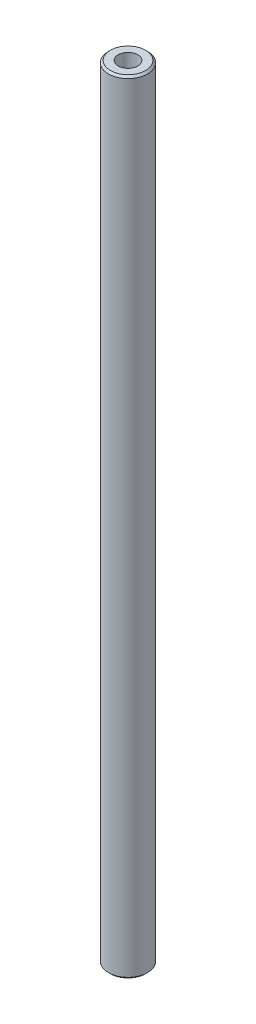
ISO-10303-21;
HEADER;
FILE_DESCRIPTION(('STEP AP214'),'2;1');
FILE_NAME('part.step','',(''),(''),'','','');
FILE_SCHEMA(('AUTOMOTIVE_DESIGN { 1 0 10303 214 1 1 1 1 }'));
ENDSEC;
DATA;
#1=APPLICATION_CONTEXT('core data for automotive mechanical design processes');
#2=APPLICATION_PROTOCOL_DEFINITION('international standard','automotive_design',2000,#1);
#3=PRODUCT_CONTEXT('',#1,'mechanical');
#4=PRODUCT('Part','Part','',(#3));
#5=PRODUCT_RELATED_PRODUCT_CATEGORY('part','',(#4));
#6=PRODUCT_DEFINITION_FORMATION('','',#4);
#7=PRODUCT_DEFINITION_CONTEXT('part definition',#1,'design');
#8=PRODUCT_DEFINITION('design','',#6,#7);
#9=PRODUCT_DEFINITION_SHAPE('','',#8);
#10=(LENGTH_UNIT() NAMED_UNIT(*) SI_UNIT(.MILLI.,.METRE.));
#11=(NAMED_UNIT(*) PLANE_ANGLE_UNIT() SI_UNIT($,.RADIAN.));
#12=(NAMED_UNIT(*) SI_UNIT($,.STERADIAN.) SOLID_ANGLE_UNIT());
#13=UNCERTAINTY_MEASURE_WITH_UNIT(LENGTH_MEASURE(1.E-05),#10,'distance_accuracy_value','');
#14=(GEOMETRIC_REPRESENTATION_CONTEXT(3) GLOBAL_UNCERTAINTY_ASSIGNED_CONTEXT((#13)) GLOBAL_UNIT_ASSIGNED_CONTEXT((#10,
#11,#12)) REPRESENTATION_CONTEXT('',''));
#15=CARTESIAN_POINT('',(0.,0.,0.));
#16=DIRECTION('',(0.,0.,1.));
#17=DIRECTION('',(1.,0.,0.));
#18=AXIS2_PLACEMENT_3D('',#15,#16,#17);
#19=CARTESIAN_POINT('',(0.,200.,0.));
#20=DIRECTION('',(0.,-1.,0.));
#21=DIRECTION('',(0.,0.,-1.));
#22=AXIS2_PLACEMENT_3D('',#19,#20,#21);
#23=CYLINDRICAL_SURFACE('',#22,5.);
#24=CARTESIAN_POINT('',(0.,199.5,0.));
#25=DIRECTION('',(0.,1.,0.));
#26=DIRECTION('',(0.,0.,1.));
#27=AXIS2_PLACEMENT_3D('',#24,#25,#26);
#28=CIRCLE('',#27,5.);
#29=CARTESIAN_POINT('',(0.,199.5,5.));
#30=VERTEX_POINT('',#29);
#31=EDGE_CURVE('E36',#30,#30,#28,.F.);
#32=ORIENTED_EDGE('',*,*,#31,.T.);
#33=EDGE_LOOP('',(#32));
#34=FACE_BOUND('',#33,.T.);
#35=CARTESIAN_POINT('',(0.,0.499999999999973,0.));
#36=DIRECTION('',(0.,1.,0.));
#37=DIRECTION('',(0.,0.,1.));
#38=AXIS2_PLACEMENT_3D('',#35,#36,#37);
#39=CIRCLE('',#38,5.);
#40=CARTESIAN_POINT('',(0.,0.499999999999973,5.));
#41=VERTEX_POINT('',#40);
#42=EDGE_CURVE('E40',#41,#41,#39,.T.);
#43=ORIENTED_EDGE('',*,*,#42,.T.);
#44=EDGE_LOOP('',(#43));
#45=FACE_BOUND('',#44,.T.);
#46=ADVANCED_FACE('F29',(#34,#45),#23,.T.);
#47=CARTESIAN_POINT('',(0.,200.,0.));
#48=DIRECTION('',(0.,1.,0.));
#49=DIRECTION('',(0.,0.,1.));
#50=AXIS2_PLACEMENT_3D('',#47,#48,#49);
#51=PLANE('',#50);
#52=CARTESIAN_POINT('',(0.,200.,0.));
#53=DIRECTION('',(0.,1.,0.));
#54=DIRECTION('',(0.,0.,1.));
#55=AXIS2_PLACEMENT_3D('',#52,#53,#54);
#56=CIRCLE('',#55,2.5);
#57=CARTESIAN_POINT('',(0.,200.,2.5));
#58=VERTEX_POINT('',#57);
#59=EDGE_CURVE('E56',#58,#58,#56,.T.);
#60=ORIENTED_EDGE('',*,*,#59,.F.);
#61=EDGE_LOOP('',(#60));
#62=FACE_BOUND('',#61,.T.);
#63=CARTESIAN_POINT('',(0.,200.,0.));
#64=DIRECTION('',(0.,1.,0.));
#65=DIRECTION('',(0.,0.,1.));
#66=AXIS2_PLACEMENT_3D('',#63,#64,#65);
#67=CIRCLE('',#66,4.5);
#68=CARTESIAN_POINT('',(0.,200.,4.5));
#69=VERTEX_POINT('',#68);
#70=EDGE_CURVE('E44',#69,#69,#67,.T.);
#71=ORIENTED_EDGE('',*,*,#70,.T.);
#72=EDGE_LOOP('',(#71));
#73=FACE_BOUND('',#72,.T.);
#74=ADVANCED_FACE('F71',(#62,#73),#51,.T.);
#75=CARTESIAN_POINT('',(0.,0.,0.));
#76=DIRECTION('',(0.,1.,0.));
#77=DIRECTION('',(0.,0.,1.));
#78=AXIS2_PLACEMENT_3D('',#75,#76,#77);
#79=PLANE('',#78);
#80=CARTESIAN_POINT('',(0.,0.,0.));
#81=DIRECTION('',(0.,-1.,0.));
#82=DIRECTION('',(0.,0.,-1.));
#83=AXIS2_PLACEMENT_3D('',#80,#81,#82);
#84=CIRCLE('',#83,2.5);
#85=CARTESIAN_POINT('',(0.,0.,-2.5));
#86=VERTEX_POINT('',#85);
#87=EDGE_CURVE('E50',#86,#86,#84,.T.);
#88=ORIENTED_EDGE('',*,*,#87,.F.);
#89=EDGE_LOOP('',(#88));
#90=FACE_BOUND('',#89,.T.);
#91=CARTESIAN_POINT('',(0.,0.,0.));
#92=DIRECTION('',(0.,1.,0.));
#93=DIRECTION('',(0.,0.,1.));
#94=AXIS2_PLACEMENT_3D('',#91,#92,#93);
#95=CIRCLE('',#94,4.5);
#96=CARTESIAN_POINT('',(0.,0.,4.5));
#97=VERTEX_POINT('',#96);
#98=EDGE_CURVE('E10',#97,#97,#95,.F.);
#99=ORIENTED_EDGE('',*,*,#98,.T.);
#100=EDGE_LOOP('',(#99));
#101=FACE_BOUND('',#100,.T.);
#102=ADVANCED_FACE('F74',(#90,#101),#79,.F.);
#103=CARTESIAN_POINT('',(0.,200.,0.));
#104=DIRECTION('',(0.,-1.,0.));
#105=DIRECTION('',(0.,0.,-1.));
#106=AXIS2_PLACEMENT_3D('',#103,#104,#105);
#107=CONICAL_SURFACE('',#106,4.5,0.785398163397472);
#108=ORIENTED_EDGE('',*,*,#31,.F.);
#109=EDGE_LOOP('',(#108));
#110=FACE_BOUND('',#109,.T.);
#111=ORIENTED_EDGE('',*,*,#70,.F.);
#112=EDGE_LOOP('',(#111));
#113=FACE_BOUND('',#112,.T.);
#114=ADVANCED_FACE('F78',(#110,#113),#107,.T.);
#115=CARTESIAN_POINT('',(0.,0.499999999999973,0.));
#116=DIRECTION('',(0.,1.,0.));
#117=DIRECTION('',(0.,0.,1.));
#118=AXIS2_PLACEMENT_3D('',#115,#116,#117);
#119=CONICAL_SURFACE('',#118,5.,0.785398163397472);
#120=ORIENTED_EDGE('',*,*,#98,.F.);
#121=EDGE_LOOP('',(#120));
#122=FACE_BOUND('',#121,.T.);
#123=ORIENTED_EDGE('',*,*,#42,.F.);
#124=EDGE_LOOP('',(#123));
#125=FACE_BOUND('',#124,.T.);
#126=ADVANCED_FACE('F31',(#122,#125),#119,.T.);
#127=CARTESIAN_POINT('',(0.,15.,0.));
#128=DIRECTION('',(0.,-1.,0.));
#129=DIRECTION('',(0.,0.,-1.));
#130=AXIS2_PLACEMENT_3D('',#127,#128,#129);
#131=CYLINDRICAL_SURFACE('',#130,2.5);
#132=CARTESIAN_POINT('',(0.,15.,0.));
#133=DIRECTION('',(0.,-1.,0.));
#134=DIRECTION('',(0.,0.,-1.));
#135=AXIS2_PLACEMENT_3D('',#132,#133,#134);
#136=CIRCLE('',#135,2.5);
#137=CARTESIAN_POINT('',(0.,15.,-2.5));
#138=VERTEX_POINT('',#137);
#139=EDGE_CURVE('E49',#138,#138,#136,.T.);
#140=ORIENTED_EDGE('',*,*,#139,.F.);
#141=EDGE_LOOP('',(#140));
#142=FACE_BOUND('',#141,.T.);
#143=ORIENTED_EDGE('',*,*,#87,.T.);
#144=EDGE_LOOP('',(#143));
#145=FACE_BOUND('',#144,.T.);
#146=ADVANCED_FACE('F85',(#142,#145),#131,.F.);
#147=CARTESIAN_POINT('',(0.,15.,0.));
#148=DIRECTION('',(0.,-1.,0.));
#149=DIRECTION('',(0.,0.,-1.));
#150=AXIS2_PLACEMENT_3D('',#147,#148,#149);
#151=PLANE('',#150);
#152=ORIENTED_EDGE('',*,*,#139,.T.);
#153=EDGE_LOOP('',(#152));
#154=FACE_BOUND('',#153,.T.);
#155=ADVANCED_FACE('F67',(#154),#151,.T.);
#156=CARTESIAN_POINT('',(0.,185.,0.));
#157=DIRECTION('',(0.,1.,0.));
#158=DIRECTION('',(0.,0.,1.));
#159=AXIS2_PLACEMENT_3D('',#156,#157,#158);
#160=CYLINDRICAL_SURFACE('',#159,2.5);
#161=CARTESIAN_POINT('',(0.,185.,0.));
#162=DIRECTION('',(0.,1.,0.));
#163=DIRECTION('',(0.,0.,1.));
#164=AXIS2_PLACEMENT_3D('',#161,#162,#163);
#165=CIRCLE('',#164,2.5);
#166=CARTESIAN_POINT('',(0.,185.,2.5));
#167=VERTEX_POINT('',#166);
#168=EDGE_CURVE('E53',#167,#167,#165,.T.);
#169=ORIENTED_EDGE('',*,*,#168,.F.);
#170=EDGE_LOOP('',(#169));
#171=FACE_BOUND('',#170,.T.);
#172=ORIENTED_EDGE('',*,*,#59,.T.);
#173=EDGE_LOOP('',(#172));
#174=FACE_BOUND('',#173,.T.);
#175=ADVANCED_FACE('F64',(#171,#174),#160,.F.);
#176=CARTESIAN_POINT('',(0.,185.,0.));
#177=DIRECTION('',(0.,1.,0.));
#178=DIRECTION('',(0.,0.,1.));
#179=AXIS2_PLACEMENT_3D('',#176,#177,#178);
#180=PLANE('',#179);
#181=ORIENTED_EDGE('',*,*,#168,.T.);
#182=EDGE_LOOP('',(#181));
#183=FACE_BOUND('',#182,.T.);
#184=ADVANCED_FACE('F62',(#183),#180,.T.);
#185=CLOSED_SHELL('',(#46,#74,#102,#114,#126,#146,#155,#175,#184));
#186=MANIFOLD_SOLID_BREP('B2',#185);
#187=ADVANCED_BREP_SHAPE_REPRESENTATION('',(#18,#186),#14);
#188=SHAPE_DEFINITION_REPRESENTATION(#9,#187);
ENDSEC;
END-ISO-10303-21;
